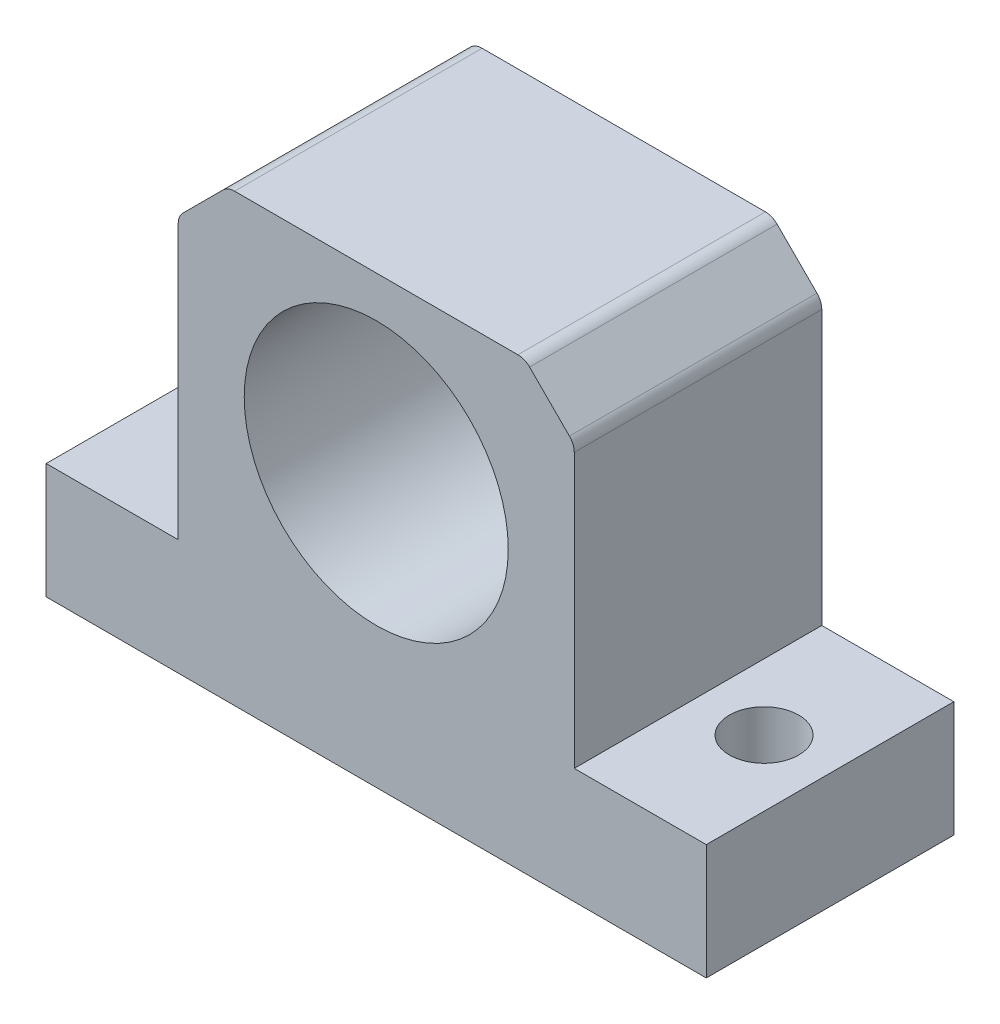
ISO-10303-21;
HEADER;
FILE_DESCRIPTION(('STEP AP214'),'2;1');
FILE_NAME('part.step','',(''),(''),'','','');
FILE_SCHEMA(('AUTOMOTIVE_DESIGN { 1 0 10303 214 1 1 1 1 }'));
ENDSEC;
DATA;
#1=APPLICATION_CONTEXT('core data for automotive mechanical design processes');
#2=APPLICATION_PROTOCOL_DEFINITION('international standard','automotive_design',2000,#1);
#3=PRODUCT_CONTEXT('',#1,'mechanical');
#4=PRODUCT('Part','Part','',(#3));
#5=PRODUCT_RELATED_PRODUCT_CATEGORY('part','',(#4));
#6=PRODUCT_DEFINITION_FORMATION('','',#4);
#7=PRODUCT_DEFINITION_CONTEXT('part definition',#1,'design');
#8=PRODUCT_DEFINITION('design','',#6,#7);
#9=PRODUCT_DEFINITION_SHAPE('','',#8);
#10=(LENGTH_UNIT() NAMED_UNIT(*) SI_UNIT(.MILLI.,.METRE.));
#11=(NAMED_UNIT(*) PLANE_ANGLE_UNIT() SI_UNIT($,.RADIAN.));
#12=(NAMED_UNIT(*) SI_UNIT($,.STERADIAN.) SOLID_ANGLE_UNIT());
#13=UNCERTAINTY_MEASURE_WITH_UNIT(LENGTH_MEASURE(1.E-05),#10,'distance_accuracy_value','');
#14=(GEOMETRIC_REPRESENTATION_CONTEXT(3) GLOBAL_UNCERTAINTY_ASSIGNED_CONTEXT((#13)) GLOBAL_UNIT_ASSIGNED_CONTEXT((#10,
#11,#12)) REPRESENTATION_CONTEXT('',''));
#15=CARTESIAN_POINT('',(0.,0.,0.));
#16=DIRECTION('',(0.,0.,1.));
#17=DIRECTION('',(1.,0.,0.));
#18=AXIS2_PLACEMENT_3D('',#15,#16,#17);
#19=CARTESIAN_POINT('',(20.,0.,15.));
#20=DIRECTION('',(0.,1.,0.));
#21=DIRECTION('',(0.,0.,1.));
#22=AXIS2_PLACEMENT_3D('',#19,#20,#21);
#23=PLANE('',#22);
#24=CARTESIAN_POINT('',(-16.,0.,7.5));
#25=DIRECTION('',(0.,-1.,0.));
#26=DIRECTION('',(0.,0.,-1.));
#27=AXIS2_PLACEMENT_3D('',#24,#25,#26);
#28=CIRCLE('',#27,2.09999999999999);
#29=CARTESIAN_POINT('',(-16.,0.,5.40000000000001));
#30=VERTEX_POINT('',#29);
#31=EDGE_CURVE('E342',#30,#30,#28,.T.);
#32=ORIENTED_EDGE('',*,*,#31,.F.);
#33=EDGE_LOOP('',(#32));
#34=FACE_BOUND('',#33,.T.);
#35=DIRECTION('',(1.,0.,0.));
#36=VECTOR('',#35,1.);
#37=CARTESIAN_POINT('',(20.,0.,0.));
#38=LINE('',#37,#36);
#39=CARTESIAN_POINT('',(-20.,0.,0.));
#40=VERTEX_POINT('',#39);
#41=CARTESIAN_POINT('',(20.,0.,0.));
#42=VERTEX_POINT('',#41);
#43=EDGE_CURVE('E170',#40,#42,#38,.T.);
#44=ORIENTED_EDGE('',*,*,#43,.T.);
#45=DIRECTION('',(0.,0.,-1.));
#46=VECTOR('',#45,1.);
#47=CARTESIAN_POINT('',(20.,0.,15.));
#48=LINE('',#47,#46);
#49=CARTESIAN_POINT('',(20.,0.,15.));
#50=VERTEX_POINT('',#49);
#51=EDGE_CURVE('E273',#50,#42,#48,.T.);
#52=ORIENTED_EDGE('',*,*,#51,.F.);
#53=DIRECTION('',(1.,0.,0.));
#54=VECTOR('',#53,1.);
#55=CARTESIAN_POINT('',(20.,0.,15.));
#56=LINE('',#55,#54);
#57=CARTESIAN_POINT('',(-20.,0.,15.));
#58=VERTEX_POINT('',#57);
#59=EDGE_CURVE('E165',#58,#50,#56,.T.);
#60=ORIENTED_EDGE('',*,*,#59,.F.);
#61=DIRECTION('',(0.,0.,-1.));
#62=VECTOR('',#61,1.);
#63=CARTESIAN_POINT('',(-20.,0.,15.));
#64=LINE('',#63,#62);
#65=EDGE_CURVE('E299',#58,#40,#64,.T.);
#66=ORIENTED_EDGE('',*,*,#65,.T.);
#67=EDGE_LOOP('',(#44,#52,#60,#66));
#68=FACE_BOUND('',#67,.T.);
#69=CARTESIAN_POINT('',(16.,0.,7.5));
#70=DIRECTION('',(0.,-1.,0.));
#71=DIRECTION('',(0.,0.,-1.));
#72=AXIS2_PLACEMENT_3D('',#69,#70,#71);
#73=CIRCLE('',#72,2.09999999999999);
#74=CARTESIAN_POINT('',(16.,0.,5.40000000000001));
#75=VERTEX_POINT('',#74);
#76=EDGE_CURVE('E330',#75,#75,#73,.T.);
#77=ORIENTED_EDGE('',*,*,#76,.F.);
#78=EDGE_LOOP('',(#77));
#79=FACE_BOUND('',#78,.T.);
#80=ADVANCED_FACE('F45',(#34,#68,#79),#23,.F.);
#81=CARTESIAN_POINT('',(0.,16.5,15.));
#82=DIRECTION('',(0.,0.,-1.));
#83=DIRECTION('',(-1.,0.,0.));
#84=AXIS2_PLACEMENT_3D('',#81,#82,#83);
#85=CYLINDRICAL_SURFACE('',#84,8.);
#86=CARTESIAN_POINT('',(0.,16.5,15.));
#87=DIRECTION('',(0.,0.,1.));
#88=DIRECTION('',(1.,0.,0.));
#89=AXIS2_PLACEMENT_3D('',#86,#87,#88);
#90=CIRCLE('',#89,8.);
#91=CARTESIAN_POINT('',(8.,16.5,15.));
#92=VERTEX_POINT('',#91);
#93=EDGE_CURVE('E277',#92,#92,#90,.T.);
#94=ORIENTED_EDGE('',*,*,#93,.T.);
#95=EDGE_LOOP('',(#94));
#96=FACE_BOUND('',#95,.T.);
#97=CARTESIAN_POINT('',(0.,16.5,3.));
#98=DIRECTION('',(0.,0.,-1.));
#99=DIRECTION('',(-1.,0.,0.));
#100=AXIS2_PLACEMENT_3D('',#97,#98,#99);
#101=CIRCLE('',#100,8.);
#102=CARTESIAN_POINT('',(-8.,16.5,3.));
#103=VERTEX_POINT('',#102);
#104=EDGE_CURVE('E350',#103,#103,#101,.T.);
#105=ORIENTED_EDGE('',*,*,#104,.T.);
#106=EDGE_LOOP('',(#105));
#107=FACE_BOUND('',#106,.T.);
#108=ADVANCED_FACE('F325',(#96,#107),#85,.F.);
#109=CARTESIAN_POINT('',(0.,0.,15.));
#110=DIRECTION('',(0.,0.,1.));
#111=DIRECTION('',(1.,0.,0.));
#112=AXIS2_PLACEMENT_3D('',#109,#110,#111);
#113=PLANE('',#112);
#114=DIRECTION('',(0.707106781186549,0.707106781186546,0.));
#115=VECTOR('',#114,1.);
#116=CARTESIAN_POINT('',(-18.,18.,15.));
#117=LINE('',#116,#115);
#118=CARTESIAN_POINT('',(-9.29289321881345,26.7071067811865,15.));
#119=VERTEX_POINT('',#118);
#120=CARTESIAN_POINT('',(-11.7071067811865,24.2928932188135,15.));
#121=VERTEX_POINT('',#120);
#122=EDGE_CURVE('E193',#119,#121,#117,.F.);
#123=ORIENTED_EDGE('',*,*,#122,.T.);
#124=CARTESIAN_POINT('',(-11.,23.5857864376269,15.));
#125=DIRECTION('',(0.,0.,1.));
#126=DIRECTION('',(1.,0.,0.));
#127=AXIS2_PLACEMENT_3D('',#124,#125,#126);
#128=CIRCLE('',#127,1.);
#129=CARTESIAN_POINT('',(-12.,23.5857864376269,15.));
#130=VERTEX_POINT('',#129);
#131=EDGE_CURVE('E226',#121,#130,#128,.T.);
#132=ORIENTED_EDGE('',*,*,#131,.T.);
#133=DIRECTION('',(0.,-1.,0.));
#134=VECTOR('',#133,1.);
#135=CARTESIAN_POINT('',(-12.,7.,15.));
#136=LINE('',#135,#134);
#137=CARTESIAN_POINT('',(-12.,7.,15.));
#138=VERTEX_POINT('',#137);
#139=EDGE_CURVE('E260',#130,#138,#136,.T.);
#140=ORIENTED_EDGE('',*,*,#139,.T.);
#141=DIRECTION('',(-1.,0.,0.));
#142=VECTOR('',#141,1.);
#143=CARTESIAN_POINT('',(-20.,7.,15.));
#144=LINE('',#143,#142);
#145=CARTESIAN_POINT('',(-20.,7.,15.));
#146=VERTEX_POINT('',#145);
#147=EDGE_CURVE('E265',#138,#146,#144,.T.);
#148=ORIENTED_EDGE('',*,*,#147,.T.);
#149=DIRECTION('',(0.,-1.,0.));
#150=VECTOR('',#149,1.);
#151=CARTESIAN_POINT('',(-20.,0.,15.));
#152=LINE('',#151,#150);
#153=EDGE_CURVE('E268',#146,#58,#152,.T.);
#154=ORIENTED_EDGE('',*,*,#153,.T.);
#155=ORIENTED_EDGE('',*,*,#59,.T.);
#156=DIRECTION('',(0.,1.,0.));
#157=VECTOR('',#156,1.);
#158=CARTESIAN_POINT('',(20.,0.,15.));
#159=LINE('',#158,#157);
#160=CARTESIAN_POINT('',(20.,7.,15.));
#161=VERTEX_POINT('',#160);
#162=EDGE_CURVE('E158',#50,#161,#159,.T.);
#163=ORIENTED_EDGE('',*,*,#162,.T.);
#164=DIRECTION('',(-1.,0.,0.));
#165=VECTOR('',#164,1.);
#166=CARTESIAN_POINT('',(20.,7.,15.));
#167=LINE('',#166,#165);
#168=CARTESIAN_POINT('',(12.,7.,15.));
#169=VERTEX_POINT('',#168);
#170=EDGE_CURVE('E147',#161,#169,#167,.T.);
#171=ORIENTED_EDGE('',*,*,#170,.T.);
#172=DIRECTION('',(0.,1.,0.));
#173=VECTOR('',#172,1.);
#174=CARTESIAN_POINT('',(12.,7.,15.));
#175=LINE('',#174,#173);
#176=CARTESIAN_POINT('',(12.,23.5857864376269,15.));
#177=VERTEX_POINT('',#176);
#178=EDGE_CURVE('E157',#169,#177,#175,.T.);
#179=ORIENTED_EDGE('',*,*,#178,.T.);
#180=CARTESIAN_POINT('',(11.,23.5857864376269,15.));
#181=DIRECTION('',(0.,0.,1.));
#182=DIRECTION('',(1.,0.,0.));
#183=AXIS2_PLACEMENT_3D('',#180,#181,#182);
#184=CIRCLE('',#183,1.);
#185=CARTESIAN_POINT('',(11.7071067811865,24.2928932188135,15.));
#186=VERTEX_POINT('',#185);
#187=EDGE_CURVE('E67',#177,#186,#184,.T.);
#188=ORIENTED_EDGE('',*,*,#187,.T.);
#189=DIRECTION('',(0.707106781186547,-0.707106781186548,0.));
#190=VECTOR('',#189,1.);
#191=CARTESIAN_POINT('',(18.,18.,15.));
#192=LINE('',#191,#190);
#193=CARTESIAN_POINT('',(9.29289321881345,26.7071067811865,15.));
#194=VERTEX_POINT('',#193);
#195=EDGE_CURVE('E190',#186,#194,#192,.F.);
#196=ORIENTED_EDGE('',*,*,#195,.T.);
#197=CARTESIAN_POINT('',(8.58578643762691,26.,15.));
#198=DIRECTION('',(0.,0.,1.));
#199=DIRECTION('',(1.,0.,0.));
#200=AXIS2_PLACEMENT_3D('',#197,#198,#199);
#201=CIRCLE('',#200,1.);
#202=CARTESIAN_POINT('',(8.58578643762691,27.,15.));
#203=VERTEX_POINT('',#202);
#204=EDGE_CURVE('E220',#194,#203,#201,.T.);
#205=ORIENTED_EDGE('',*,*,#204,.T.);
#206=DIRECTION('',(-1.,0.,0.));
#207=VECTOR('',#206,1.);
#208=CARTESIAN_POINT('',(-12.,27.,15.));
#209=LINE('',#208,#207);
#210=CARTESIAN_POINT('',(-8.5857864376269,27.,15.));
#211=VERTEX_POINT('',#210);
#212=EDGE_CURVE('E256',#203,#211,#209,.T.);
#213=ORIENTED_EDGE('',*,*,#212,.T.);
#214=CARTESIAN_POINT('',(-8.5857864376269,26.,15.));
#215=DIRECTION('',(0.,0.,1.));
#216=DIRECTION('',(1.,0.,0.));
#217=AXIS2_PLACEMENT_3D('',#214,#215,#216);
#218=CIRCLE('',#217,1.);
#219=EDGE_CURVE('E223',#211,#119,#218,.T.);
#220=ORIENTED_EDGE('',*,*,#219,.T.);
#221=EDGE_LOOP('',(#123,#132,#140,#148,#154,#155,#163,#171,#179,#188,#196,#205,#213,#220));
#222=FACE_BOUND('',#221,.T.);
#223=ORIENTED_EDGE('',*,*,#93,.F.);
#224=EDGE_LOOP('',(#223));
#225=FACE_BOUND('',#224,.T.);
#226=ADVANCED_FACE('F162',(#222,#225),#113,.T.);
#227=CARTESIAN_POINT('',(0.,0.,0.));
#228=DIRECTION('',(0.,0.,1.));
#229=DIRECTION('',(1.,0.,0.));
#230=AXIS2_PLACEMENT_3D('',#227,#228,#229);
#231=PLANE('',#230);
#232=DIRECTION('',(0.,-1.,0.));
#233=VECTOR('',#232,1.);
#234=CARTESIAN_POINT('',(-12.,7.,0.));
#235=LINE('',#234,#233);
#236=CARTESIAN_POINT('',(-12.,23.5857864376269,0.));
#237=VERTEX_POINT('',#236);
#238=CARTESIAN_POINT('',(-12.,7.,0.));
#239=VERTEX_POINT('',#238);
#240=EDGE_CURVE('E286',#237,#239,#235,.T.);
#241=ORIENTED_EDGE('',*,*,#240,.F.);
#242=CARTESIAN_POINT('',(-11.,23.5857864376269,0.));
#243=DIRECTION('',(0.,0.,1.));
#244=DIRECTION('',(1.,0.,0.));
#245=AXIS2_PLACEMENT_3D('',#242,#243,#244);
#246=CIRCLE('',#245,1.);
#247=CARTESIAN_POINT('',(-11.7071067811865,24.2928932188135,0.));
#248=VERTEX_POINT('',#247);
#249=EDGE_CURVE('E209',#237,#248,#246,.F.);
#250=ORIENTED_EDGE('',*,*,#249,.T.);
#251=DIRECTION('',(-0.707106781186549,-0.707106781186546,0.));
#252=VECTOR('',#251,1.);
#253=CARTESIAN_POINT('',(-12.,24.,0.));
#254=LINE('',#253,#252);
#255=CARTESIAN_POINT('',(-9.29289321881345,26.7071067811865,0.));
#256=VERTEX_POINT('',#255);
#257=EDGE_CURVE('E181',#248,#256,#254,.F.);
#258=ORIENTED_EDGE('',*,*,#257,.T.);
#259=CARTESIAN_POINT('',(-8.5857864376269,26.,0.));
#260=DIRECTION('',(0.,0.,1.));
#261=DIRECTION('',(1.,0.,0.));
#262=AXIS2_PLACEMENT_3D('',#259,#260,#261);
#263=CIRCLE('',#262,1.);
#264=CARTESIAN_POINT('',(-8.5857864376269,27.,0.));
#265=VERTEX_POINT('',#264);
#266=EDGE_CURVE('E206',#256,#265,#263,.F.);
#267=ORIENTED_EDGE('',*,*,#266,.T.);
#268=DIRECTION('',(-1.,0.,0.));
#269=VECTOR('',#268,1.);
#270=CARTESIAN_POINT('',(-12.,27.,0.));
#271=LINE('',#270,#269);
#272=CARTESIAN_POINT('',(8.58578643762691,27.,0.));
#273=VERTEX_POINT('',#272);
#274=EDGE_CURVE('E282',#273,#265,#271,.T.);
#275=ORIENTED_EDGE('',*,*,#274,.F.);
#276=CARTESIAN_POINT('',(8.58578643762691,26.,0.));
#277=DIRECTION('',(0.,0.,1.));
#278=DIRECTION('',(1.,0.,0.));
#279=AXIS2_PLACEMENT_3D('',#276,#277,#278);
#280=CIRCLE('',#279,1.);
#281=CARTESIAN_POINT('',(9.29289321881346,26.7071067811865,0.));
#282=VERTEX_POINT('',#281);
#283=EDGE_CURVE('E203',#273,#282,#280,.F.);
#284=ORIENTED_EDGE('',*,*,#283,.T.);
#285=DIRECTION('',(-0.707106781186547,0.707106781186548,0.));
#286=VECTOR('',#285,1.);
#287=CARTESIAN_POINT('',(9.00000000000001,27.,0.));
#288=LINE('',#287,#286);
#289=CARTESIAN_POINT('',(11.7071067811865,24.2928932188135,0.));
#290=VERTEX_POINT('',#289);
#291=EDGE_CURVE('E176',#282,#290,#288,.F.);
#292=ORIENTED_EDGE('',*,*,#291,.T.);
#293=CARTESIAN_POINT('',(11.,23.5857864376269,0.));
#294=DIRECTION('',(0.,0.,1.));
#295=DIRECTION('',(1.,0.,0.));
#296=AXIS2_PLACEMENT_3D('',#293,#294,#295);
#297=CIRCLE('',#296,1.);
#298=CARTESIAN_POINT('',(12.,23.5857864376269,0.));
#299=VERTEX_POINT('',#298);
#300=EDGE_CURVE('E200',#290,#299,#297,.F.);
#301=ORIENTED_EDGE('',*,*,#300,.T.);
#302=DIRECTION('',(0.,1.,0.));
#303=VECTOR('',#302,1.);
#304=CARTESIAN_POINT('',(12.,7.,0.));
#305=LINE('',#304,#303);
#306=CARTESIAN_POINT('',(12.,7.,0.));
#307=VERTEX_POINT('',#306);
#308=EDGE_CURVE('E254',#307,#299,#305,.T.);
#309=ORIENTED_EDGE('',*,*,#308,.F.);
#310=DIRECTION('',(-1.,0.,0.));
#311=VECTOR('',#310,1.);
#312=CARTESIAN_POINT('',(20.,7.,0.));
#313=LINE('',#312,#311);
#314=CARTESIAN_POINT('',(20.,7.,0.));
#315=VERTEX_POINT('',#314);
#316=EDGE_CURVE('E276',#315,#307,#313,.T.);
#317=ORIENTED_EDGE('',*,*,#316,.F.);
#318=DIRECTION('',(0.,1.,0.));
#319=VECTOR('',#318,1.);
#320=CARTESIAN_POINT('',(20.,0.,0.));
#321=LINE('',#320,#319);
#322=EDGE_CURVE('E174',#42,#315,#321,.T.);
#323=ORIENTED_EDGE('',*,*,#322,.F.);
#324=ORIENTED_EDGE('',*,*,#43,.F.);
#325=DIRECTION('',(0.,-1.,0.));
#326=VECTOR('',#325,1.);
#327=CARTESIAN_POINT('',(-20.,0.,0.));
#328=LINE('',#327,#326);
#329=CARTESIAN_POINT('',(-20.,7.,0.));
#330=VERTEX_POINT('',#329);
#331=EDGE_CURVE('E292',#330,#40,#328,.T.);
#332=ORIENTED_EDGE('',*,*,#331,.F.);
#333=DIRECTION('',(-1.,0.,0.));
#334=VECTOR('',#333,1.);
#335=CARTESIAN_POINT('',(-20.,7.,0.));
#336=LINE('',#335,#334);
#337=EDGE_CURVE('E289',#239,#330,#336,.T.);
#338=ORIENTED_EDGE('',*,*,#337,.F.);
#339=EDGE_LOOP('',(#241,#250,#258,#267,#275,#284,#292,#301,#309,#317,#323,#324,#332,#338));
#340=FACE_BOUND('',#339,.T.);
#341=CARTESIAN_POINT('',(0.,16.5,0.));
#342=DIRECTION('',(0.,0.,-1.));
#343=DIRECTION('',(-1.,0.,0.));
#344=AXIS2_PLACEMENT_3D('',#341,#342,#343);
#345=CIRCLE('',#344,5.);
#346=CARTESIAN_POINT('',(-5.,16.5,0.));
#347=VERTEX_POINT('',#346);
#348=EDGE_CURVE('E339',#347,#347,#345,.T.);
#349=ORIENTED_EDGE('',*,*,#348,.F.);
#350=EDGE_LOOP('',(#349));
#351=FACE_BOUND('',#350,.T.);
#352=ADVANCED_FACE('F246',(#340,#351),#231,.F.);
#353=CARTESIAN_POINT('',(20.,0.,15.));
#354=DIRECTION('',(-1.,0.,0.));
#355=DIRECTION('',(0.,0.,1.));
#356=AXIS2_PLACEMENT_3D('',#353,#354,#355);
#357=PLANE('',#356);
#358=ORIENTED_EDGE('',*,*,#322,.T.);
#359=DIRECTION('',(0.,0.,-1.));
#360=VECTOR('',#359,1.);
#361=CARTESIAN_POINT('',(20.,7.,15.));
#362=LINE('',#361,#360);
#363=EDGE_CURVE('E151',#161,#315,#362,.T.);
#364=ORIENTED_EDGE('',*,*,#363,.F.);
#365=ORIENTED_EDGE('',*,*,#162,.F.);
#366=ORIENTED_EDGE('',*,*,#51,.T.);
#367=EDGE_LOOP('',(#358,#364,#365,#366));
#368=FACE_BOUND('',#367,.T.);
#369=ADVANCED_FACE('F172',(#368),#357,.F.);
#370=CARTESIAN_POINT('',(20.,7.,15.));
#371=DIRECTION('',(0.,-1.,0.));
#372=DIRECTION('',(0.,0.,-1.));
#373=AXIS2_PLACEMENT_3D('',#370,#371,#372);
#374=PLANE('',#373);
#375=CARTESIAN_POINT('',(16.,7.,7.5));
#376=DIRECTION('',(0.,-1.,0.));
#377=DIRECTION('',(0.,0.,-1.));
#378=AXIS2_PLACEMENT_3D('',#375,#376,#377);
#379=CIRCLE('',#378,2.09999999999999);
#380=CARTESIAN_POINT('',(16.,7.,5.40000000000001));
#381=VERTEX_POINT('',#380);
#382=EDGE_CURVE('E333',#381,#381,#379,.T.);
#383=ORIENTED_EDGE('',*,*,#382,.T.);
#384=EDGE_LOOP('',(#383));
#385=FACE_BOUND('',#384,.T.);
#386=ORIENTED_EDGE('',*,*,#316,.T.);
#387=DIRECTION('',(0.,0.,-1.));
#388=VECTOR('',#387,1.);
#389=CARTESIAN_POINT('',(12.,7.,15.));
#390=LINE('',#389,#388);
#391=EDGE_CURVE('E154',#169,#307,#390,.T.);
#392=ORIENTED_EDGE('',*,*,#391,.F.);
#393=ORIENTED_EDGE('',*,*,#170,.F.);
#394=ORIENTED_EDGE('',*,*,#363,.T.);
#395=EDGE_LOOP('',(#386,#392,#393,#394));
#396=FACE_BOUND('',#395,.T.);
#397=ADVANCED_FACE('F149',(#385,#396),#374,.F.);
#398=CARTESIAN_POINT('',(12.,7.,15.));
#399=DIRECTION('',(-1.,0.,0.));
#400=DIRECTION('',(0.,0.,1.));
#401=AXIS2_PLACEMENT_3D('',#398,#399,#400);
#402=PLANE('',#401);
#403=ORIENTED_EDGE('',*,*,#308,.T.);
#404=DIRECTION('',(0.,0.,-1.));
#405=VECTOR('',#404,1.);
#406=CARTESIAN_POINT('',(12.,23.5857864376269,15.));
#407=LINE('',#406,#405);
#408=EDGE_CURVE('E11',#299,#177,#407,.F.);
#409=ORIENTED_EDGE('',*,*,#408,.T.);
#410=ORIENTED_EDGE('',*,*,#178,.F.);
#411=ORIENTED_EDGE('',*,*,#391,.T.);
#412=EDGE_LOOP('',(#403,#409,#410,#411));
#413=FACE_BOUND('',#412,.T.);
#414=ADVANCED_FACE('F253',(#413),#402,.F.);
#415=CARTESIAN_POINT('',(-12.,27.,15.));
#416=DIRECTION('',(0.,-1.,0.));
#417=DIRECTION('',(0.,0.,-1.));
#418=AXIS2_PLACEMENT_3D('',#415,#416,#417);
#419=PLANE('',#418);
#420=ORIENTED_EDGE('',*,*,#274,.T.);
#421=DIRECTION('',(0.,0.,-1.));
#422=VECTOR('',#421,1.);
#423=CARTESIAN_POINT('',(-8.5857864376269,27.,15.));
#424=LINE('',#423,#422);
#425=EDGE_CURVE('E233',#265,#211,#424,.F.);
#426=ORIENTED_EDGE('',*,*,#425,.T.);
#427=ORIENTED_EDGE('',*,*,#212,.F.);
#428=DIRECTION('',(0.,0.,1.));
#429=VECTOR('',#428,1.);
#430=CARTESIAN_POINT('',(8.58578643762691,27.,0.));
#431=LINE('',#430,#429);
#432=EDGE_CURVE('E229',#203,#273,#431,.F.);
#433=ORIENTED_EDGE('',*,*,#432,.T.);
#434=EDGE_LOOP('',(#420,#426,#427,#433));
#435=FACE_BOUND('',#434,.T.);
#436=ADVANCED_FACE('F381',(#435),#419,.F.);
#437=CARTESIAN_POINT('',(-12.,7.,15.));
#438=DIRECTION('',(1.,0.,0.));
#439=DIRECTION('',(0.,0.,-1.));
#440=AXIS2_PLACEMENT_3D('',#437,#438,#439);
#441=PLANE('',#440);
#442=ORIENTED_EDGE('',*,*,#139,.F.);
#443=DIRECTION('',(0.,0.,1.));
#444=VECTOR('',#443,1.);
#445=CARTESIAN_POINT('',(-12.,23.5857864376269,0.));
#446=LINE('',#445,#444);
#447=EDGE_CURVE('E196',#130,#237,#446,.F.);
#448=ORIENTED_EDGE('',*,*,#447,.T.);
#449=ORIENTED_EDGE('',*,*,#240,.T.);
#450=DIRECTION('',(0.,0.,-1.));
#451=VECTOR('',#450,1.);
#452=CARTESIAN_POINT('',(-12.,7.,15.));
#453=LINE('',#452,#451);
#454=EDGE_CURVE('E183',#138,#239,#453,.T.);
#455=ORIENTED_EDGE('',*,*,#454,.F.);
#456=EDGE_LOOP('',(#442,#448,#449,#455));
#457=FACE_BOUND('',#456,.T.);
#458=ADVANCED_FACE('F377',(#457),#441,.F.);
#459=CARTESIAN_POINT('',(-20.,7.,15.));
#460=DIRECTION('',(0.,-1.,0.));
#461=DIRECTION('',(0.,0.,-1.));
#462=AXIS2_PLACEMENT_3D('',#459,#460,#461);
#463=PLANE('',#462);
#464=CARTESIAN_POINT('',(-16.,7.,7.5));
#465=DIRECTION('',(0.,-1.,0.));
#466=DIRECTION('',(0.,0.,-1.));
#467=AXIS2_PLACEMENT_3D('',#464,#465,#466);
#468=CIRCLE('',#467,2.09999999999999);
#469=CARTESIAN_POINT('',(-16.,7.,5.40000000000001));
#470=VERTEX_POINT('',#469);
#471=EDGE_CURVE('E334',#470,#470,#468,.T.);
#472=ORIENTED_EDGE('',*,*,#471,.T.);
#473=EDGE_LOOP('',(#472));
#474=FACE_BOUND('',#473,.T.);
#475=ORIENTED_EDGE('',*,*,#337,.T.);
#476=DIRECTION('',(0.,0.,-1.));
#477=VECTOR('',#476,1.);
#478=CARTESIAN_POINT('',(-20.,7.,15.));
#479=LINE('',#478,#477);
#480=EDGE_CURVE('E303',#146,#330,#479,.T.);
#481=ORIENTED_EDGE('',*,*,#480,.F.);
#482=ORIENTED_EDGE('',*,*,#147,.F.);
#483=ORIENTED_EDGE('',*,*,#454,.T.);
#484=EDGE_LOOP('',(#475,#481,#482,#483));
#485=FACE_BOUND('',#484,.T.);
#486=ADVANCED_FACE('F312',(#474,#485),#463,.F.);
#487=CARTESIAN_POINT('',(-20.,0.,15.));
#488=DIRECTION('',(1.,0.,0.));
#489=DIRECTION('',(0.,0.,-1.));
#490=AXIS2_PLACEMENT_3D('',#487,#488,#489);
#491=PLANE('',#490);
#492=ORIENTED_EDGE('',*,*,#331,.T.);
#493=ORIENTED_EDGE('',*,*,#65,.F.);
#494=ORIENTED_EDGE('',*,*,#153,.F.);
#495=ORIENTED_EDGE('',*,*,#480,.T.);
#496=EDGE_LOOP('',(#492,#493,#494,#495));
#497=FACE_BOUND('',#496,.T.);
#498=ADVANCED_FACE('F320',(#497),#491,.F.);
#499=CARTESIAN_POINT('',(-12.,24.,15.));
#500=DIRECTION('',(0.707106781186546,-0.707106781186549,0.));
#501=DIRECTION('',(0.,0.,-1.));
#502=AXIS2_PLACEMENT_3D('',#499,#500,#501);
#503=PLANE('',#502);
#504=ORIENTED_EDGE('',*,*,#257,.F.);
#505=DIRECTION('',(0.,0.,-1.));
#506=VECTOR('',#505,1.);
#507=CARTESIAN_POINT('',(-11.7071067811865,24.2928932188135,15.));
#508=LINE('',#507,#506);
#509=EDGE_CURVE('E215',#248,#121,#508,.F.);
#510=ORIENTED_EDGE('',*,*,#509,.T.);
#511=ORIENTED_EDGE('',*,*,#122,.F.);
#512=DIRECTION('',(0.,0.,1.));
#513=VECTOR('',#512,1.);
#514=CARTESIAN_POINT('',(-9.29289321881345,26.7071067811865,0.));
#515=LINE('',#514,#513);
#516=EDGE_CURVE('E212',#119,#256,#515,.F.);
#517=ORIENTED_EDGE('',*,*,#516,.T.);
#518=EDGE_LOOP('',(#504,#510,#511,#517));
#519=FACE_BOUND('',#518,.T.);
#520=ADVANCED_FACE('F374',(#519),#503,.F.);
#521=CARTESIAN_POINT('',(9.00000000000001,27.,15.));
#522=DIRECTION('',(-0.707106781186548,-0.707106781186547,0.));
#523=DIRECTION('',(0.,0.,-1.));
#524=AXIS2_PLACEMENT_3D('',#521,#522,#523);
#525=PLANE('',#524);
#526=ORIENTED_EDGE('',*,*,#291,.F.);
#527=DIRECTION('',(0.,0.,-1.));
#528=VECTOR('',#527,1.);
#529=CARTESIAN_POINT('',(9.29289321881346,26.7071067811865,15.));
#530=LINE('',#529,#528);
#531=EDGE_CURVE('E54',#282,#194,#530,.F.);
#532=ORIENTED_EDGE('',*,*,#531,.T.);
#533=ORIENTED_EDGE('',*,*,#195,.F.);
#534=DIRECTION('',(0.,0.,1.));
#535=VECTOR('',#534,1.);
#536=CARTESIAN_POINT('',(11.7071067811865,24.2928932188135,0.));
#537=LINE('',#536,#535);
#538=EDGE_CURVE('E237',#186,#290,#537,.F.);
#539=ORIENTED_EDGE('',*,*,#538,.T.);
#540=EDGE_LOOP('',(#526,#532,#533,#539));
#541=FACE_BOUND('',#540,.T.);
#542=ADVANCED_FACE('F241',(#541),#525,.F.);
#543=CARTESIAN_POINT('',(0.,16.5,3.));
#544=DIRECTION('',(0.,0.,-1.));
#545=DIRECTION('',(-1.,0.,0.));
#546=AXIS2_PLACEMENT_3D('',#543,#544,#545);
#547=PLANE('',#546);
#548=CARTESIAN_POINT('',(0.,16.5,3.));
#549=DIRECTION('',(0.,0.,-1.));
#550=DIRECTION('',(-1.,0.,0.));
#551=AXIS2_PLACEMENT_3D('',#548,#549,#550);
#552=CIRCLE('',#551,5.);
#553=CARTESIAN_POINT('',(-5.,16.5,3.));
#554=VERTEX_POINT('',#553);
#555=EDGE_CURVE('E346',#554,#554,#552,.T.);
#556=ORIENTED_EDGE('',*,*,#555,.T.);
#557=EDGE_LOOP('',(#556));
#558=FACE_BOUND('',#557,.T.);
#559=ORIENTED_EDGE('',*,*,#104,.F.);
#560=EDGE_LOOP('',(#559));
#561=FACE_BOUND('',#560,.T.);
#562=ADVANCED_FACE('F403',(#558,#561),#547,.F.);
#563=CARTESIAN_POINT('',(0.,16.5,3.));
#564=DIRECTION('',(0.,0.,-1.));
#565=DIRECTION('',(-1.,0.,0.));
#566=AXIS2_PLACEMENT_3D('',#563,#564,#565);
#567=CYLINDRICAL_SURFACE('',#566,5.);
#568=ORIENTED_EDGE('',*,*,#555,.F.);
#569=EDGE_LOOP('',(#568));
#570=FACE_BOUND('',#569,.T.);
#571=ORIENTED_EDGE('',*,*,#348,.T.);
#572=EDGE_LOOP('',(#571));
#573=FACE_BOUND('',#572,.T.);
#574=ADVANCED_FACE('F516',(#570,#573),#567,.F.);
#575=CARTESIAN_POINT('',(16.,0.,7.5));
#576=DIRECTION('',(0.,-1.,0.));
#577=DIRECTION('',(0.,0.,-1.));
#578=AXIS2_PLACEMENT_3D('',#575,#576,#577);
#579=CYLINDRICAL_SURFACE('',#578,2.09999999999999);
#580=ORIENTED_EDGE('',*,*,#76,.T.);
#581=EDGE_LOOP('',(#580));
#582=FACE_BOUND('',#581,.T.);
#583=ORIENTED_EDGE('',*,*,#382,.F.);
#584=EDGE_LOOP('',(#583));
#585=FACE_BOUND('',#584,.T.);
#586=ADVANCED_FACE('F504',(#582,#585),#579,.F.);
#587=CARTESIAN_POINT('',(-16.,0.,7.5));
#588=DIRECTION('',(0.,-1.,0.));
#589=DIRECTION('',(0.,0.,-1.));
#590=AXIS2_PLACEMENT_3D('',#587,#588,#589);
#591=CYLINDRICAL_SURFACE('',#590,2.09999999999999);
#592=ORIENTED_EDGE('',*,*,#31,.T.);
#593=EDGE_LOOP('',(#592));
#594=FACE_BOUND('',#593,.T.);
#595=ORIENTED_EDGE('',*,*,#471,.F.);
#596=EDGE_LOOP('',(#595));
#597=FACE_BOUND('',#596,.T.);
#598=ADVANCED_FACE('F408',(#594,#597),#591,.F.);
#599=CARTESIAN_POINT('',(-11.,23.5857864376269,15.));
#600=DIRECTION('',(0.,0.,-1.));
#601=DIRECTION('',(-1.,0.,0.));
#602=AXIS2_PLACEMENT_3D('',#599,#600,#601);
#603=CYLINDRICAL_SURFACE('',#602,1.);
#604=ORIENTED_EDGE('',*,*,#131,.F.);
#605=ORIENTED_EDGE('',*,*,#509,.F.);
#606=ORIENTED_EDGE('',*,*,#249,.F.);
#607=ORIENTED_EDGE('',*,*,#447,.F.);
#608=EDGE_LOOP('',(#604,#605,#606,#607));
#609=FACE_BOUND('',#608,.T.);
#610=ADVANCED_FACE('F404',(#609),#603,.T.);
#611=CARTESIAN_POINT('',(-8.5857864376269,26.,15.));
#612=DIRECTION('',(0.,0.,1.));
#613=DIRECTION('',(1.,0.,0.));
#614=AXIS2_PLACEMENT_3D('',#611,#612,#613);
#615=CYLINDRICAL_SURFACE('',#614,1.);
#616=ORIENTED_EDGE('',*,*,#266,.F.);
#617=ORIENTED_EDGE('',*,*,#516,.F.);
#618=ORIENTED_EDGE('',*,*,#219,.F.);
#619=ORIENTED_EDGE('',*,*,#425,.F.);
#620=EDGE_LOOP('',(#616,#617,#618,#619));
#621=FACE_BOUND('',#620,.T.);
#622=ADVANCED_FACE('F407',(#621),#615,.T.);
#623=CARTESIAN_POINT('',(8.58578643762691,26.,15.));
#624=DIRECTION('',(0.,0.,-1.));
#625=DIRECTION('',(-1.,0.,0.));
#626=AXIS2_PLACEMENT_3D('',#623,#624,#625);
#627=CYLINDRICAL_SURFACE('',#626,1.);
#628=ORIENTED_EDGE('',*,*,#204,.F.);
#629=ORIENTED_EDGE('',*,*,#531,.F.);
#630=ORIENTED_EDGE('',*,*,#283,.F.);
#631=ORIENTED_EDGE('',*,*,#432,.F.);
#632=EDGE_LOOP('',(#628,#629,#630,#631));
#633=FACE_BOUND('',#632,.T.);
#634=ADVANCED_FACE('F411',(#633),#627,.T.);
#635=CARTESIAN_POINT('',(11.,23.5857864376269,15.));
#636=DIRECTION('',(0.,0.,1.));
#637=DIRECTION('',(1.,0.,0.));
#638=AXIS2_PLACEMENT_3D('',#635,#636,#637);
#639=CYLINDRICAL_SURFACE('',#638,1.);
#640=ORIENTED_EDGE('',*,*,#300,.F.);
#641=ORIENTED_EDGE('',*,*,#538,.F.);
#642=ORIENTED_EDGE('',*,*,#187,.F.);
#643=ORIENTED_EDGE('',*,*,#408,.F.);
#644=EDGE_LOOP('',(#640,#641,#642,#643));
#645=FACE_BOUND('',#644,.T.);
#646=ADVANCED_FACE('F47',(#645),#639,.T.);
#647=CLOSED_SHELL('',(#80,#108,#226,#352,#369,#397,#414,#436,#458,#486,#498,#520,#542,#562,#574,
#586,#598,#610,#622,#634,#646));
#648=MANIFOLD_SOLID_BREP('B2',#647);
#649=ADVANCED_BREP_SHAPE_REPRESENTATION('',(#18,#648),#14);
#650=SHAPE_DEFINITION_REPRESENTATION(#9,#649);
ENDSEC;
END-ISO-10303-21;
